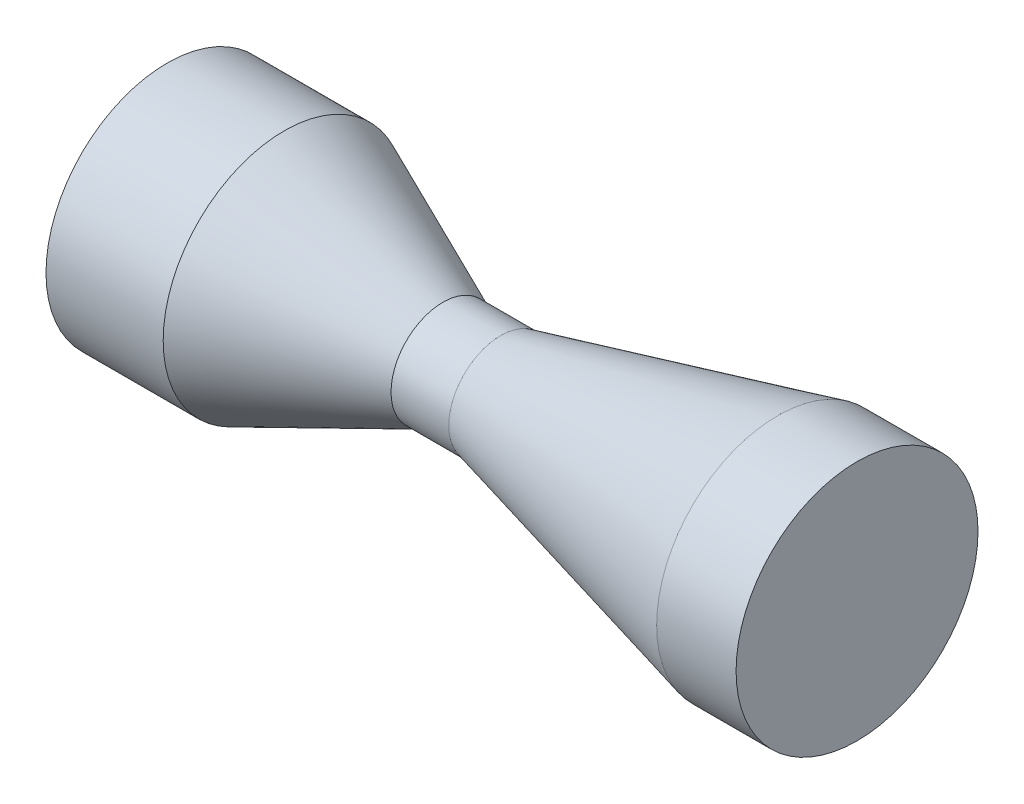
ISO-10303-21;
HEADER;
FILE_DESCRIPTION(('STEP AP214'),'2;1');
FILE_NAME('part.step','',(''),(''),'','','');
FILE_SCHEMA(('AUTOMOTIVE_DESIGN { 1 0 10303 214 1 1 1 1 }'));
ENDSEC;
DATA;
#1=APPLICATION_CONTEXT('core data for automotive mechanical design processes');
#2=APPLICATION_PROTOCOL_DEFINITION('international standard','automotive_design',2000,#1);
#3=PRODUCT_CONTEXT('',#1,'mechanical');
#4=PRODUCT('Part','Part','',(#3));
#5=PRODUCT_RELATED_PRODUCT_CATEGORY('part','',(#4));
#6=PRODUCT_DEFINITION_FORMATION('','',#4);
#7=PRODUCT_DEFINITION_CONTEXT('part definition',#1,'design');
#8=PRODUCT_DEFINITION('design','',#6,#7);
#9=PRODUCT_DEFINITION_SHAPE('','',#8);
#10=(LENGTH_UNIT() NAMED_UNIT(*) SI_UNIT(.MILLI.,.METRE.));
#11=(NAMED_UNIT(*) PLANE_ANGLE_UNIT() SI_UNIT($,.RADIAN.));
#12=(NAMED_UNIT(*) SI_UNIT($,.STERADIAN.) SOLID_ANGLE_UNIT());
#13=UNCERTAINTY_MEASURE_WITH_UNIT(LENGTH_MEASURE(1.E-05),#10,'distance_accuracy_value','');
#14=(GEOMETRIC_REPRESENTATION_CONTEXT(3) GLOBAL_UNCERTAINTY_ASSIGNED_CONTEXT((#13)) GLOBAL_UNIT_ASSIGNED_CONTEXT((#10,
#11,#12)) REPRESENTATION_CONTEXT('',''));
#15=CARTESIAN_POINT('',(0.,0.,0.));
#16=DIRECTION('',(0.,0.,1.));
#17=DIRECTION('',(1.,0.,0.));
#18=AXIS2_PLACEMENT_3D('',#15,#16,#17);
#19=CARTESIAN_POINT('',(140.821370464621,0.,0.));
#20=DIRECTION('',(1.,0.,0.));
#21=DIRECTION('',(0.,0.,-1.));
#22=AXIS2_PLACEMENT_3D('',#19,#20,#21);
#23=PLANE('',#22);
#24=CARTESIAN_POINT('',(140.821370464621,0.,0.));
#25=DIRECTION('',(1.,0.,0.));
#26=DIRECTION('',(0.,0.,-1.));
#27=AXIS2_PLACEMENT_3D('',#24,#25,#26);
#28=CIRCLE('',#27,34.9462402274546);
#29=CARTESIAN_POINT('',(140.821370464621,0.,-34.9462402274546));
#30=VERTEX_POINT('',#29);
#31=EDGE_CURVE('E119',#30,#30,#28,.T.);
#32=ORIENTED_EDGE('',*,*,#31,.T.);
#33=EDGE_LOOP('',(#32));
#34=FACE_BOUND('',#33,.T.);
#35=ADVANCED_FACE('F45',(#34),#23,.T.);
#36=CARTESIAN_POINT('',(-58.4948832055554,0.,0.));
#37=DIRECTION('',(-1.,0.,0.));
#38=DIRECTION('',(0.,0.,1.));
#39=AXIS2_PLACEMENT_3D('',#36,#37,#38);
#40=PLANE('',#39);
#41=CARTESIAN_POINT('',(-58.4948832055554,0.,0.));
#42=DIRECTION('',(-1.,0.,0.));
#43=DIRECTION('',(0.,0.,1.));
#44=AXIS2_PLACEMENT_3D('',#41,#42,#43);
#45=CIRCLE('',#44,35.);
#46=CARTESIAN_POINT('',(-58.4948832055554,0.,35.));
#47=VERTEX_POINT('',#46);
#48=EDGE_CURVE('E84',#47,#47,#45,.T.);
#49=ORIENTED_EDGE('',*,*,#48,.T.);
#50=EDGE_LOOP('',(#49));
#51=FACE_BOUND('',#50,.T.);
#52=ADVANCED_FACE('F140',(#51),#40,.T.);
#53=CARTESIAN_POINT('',(-43.0231598746545,0.,0.));
#54=DIRECTION('',(-1.,0.,0.));
#55=DIRECTION('',(0.,0.,1.));
#56=AXIS2_PLACEMENT_3D('',#53,#54,#55);
#57=CYLINDRICAL_SURFACE('',#56,35.);
#58=CARTESIAN_POINT('',(-24.6381928369166,0.,0.));
#59=DIRECTION('',(-1.,0.,0.));
#60=DIRECTION('',(0.,0.,1.));
#61=AXIS2_PLACEMENT_3D('',#58,#59,#60);
#62=CIRCLE('',#61,35.);
#63=CARTESIAN_POINT('',(-24.6381928369166,0.,35.));
#64=VERTEX_POINT('',#63);
#65=EDGE_CURVE('E85',#64,#64,#62,.T.);
#66=ORIENTED_EDGE('',*,*,#65,.T.);
#67=EDGE_LOOP('',(#66));
#68=FACE_BOUND('',#67,.T.);
#69=ORIENTED_EDGE('',*,*,#48,.F.);
#70=EDGE_LOOP('',(#69));
#71=FACE_BOUND('',#70,.T.);
#72=ADVANCED_FACE('F145',(#68,#71),#57,.T.);
#73=CARTESIAN_POINT('',(-24.6381928369166,0.,0.));
#74=DIRECTION('',(-1.,0.,0.));
#75=DIRECTION('',(0.,0.,1.));
#76=AXIS2_PLACEMENT_3D('',#73,#74,#75);
#77=CONICAL_SURFACE('',#76,35.,0.411516846067488);
#78=CARTESIAN_POINT('',(21.1875641126418,0.,0.));
#79=DIRECTION('',(-1.,0.,0.));
#80=DIRECTION('',(0.,0.,1.));
#81=AXIS2_PLACEMENT_3D('',#78,#79,#80);
#82=CIRCLE('',#81,15.);
#83=CARTESIAN_POINT('',(21.1875641126418,0.,15.));
#84=VERTEX_POINT('',#83);
#85=EDGE_CURVE('E97',#84,#84,#82,.T.);
#86=ORIENTED_EDGE('',*,*,#85,.T.);
#87=EDGE_LOOP('',(#86));
#88=FACE_BOUND('',#87,.T.);
#89=ORIENTED_EDGE('',*,*,#65,.F.);
#90=EDGE_LOOP('',(#89));
#91=FACE_BOUND('',#90,.T.);
#92=ADVANCED_FACE('F197',(#88,#91),#77,.T.);
#93=CARTESIAN_POINT('',(-43.0231598746545,0.,0.));
#94=DIRECTION('',(-1.,0.,0.));
#95=DIRECTION('',(0.,0.,1.));
#96=AXIS2_PLACEMENT_3D('',#93,#94,#95);
#97=CYLINDRICAL_SURFACE('',#96,15.);
#98=CARTESIAN_POINT('',(37.8725969783919,0.,0.));
#99=DIRECTION('',(-1.,0.,0.));
#100=DIRECTION('',(0.,0.,1.));
#101=AXIS2_PLACEMENT_3D('',#98,#99,#100);
#102=CIRCLE('',#101,15.);
#103=CARTESIAN_POINT('',(37.8725969783919,0.,15.));
#104=VERTEX_POINT('',#103);
#105=EDGE_CURVE('E102',#104,#104,#102,.T.);
#106=ORIENTED_EDGE('',*,*,#105,.T.);
#107=EDGE_LOOP('',(#106));
#108=FACE_BOUND('',#107,.T.);
#109=ORIENTED_EDGE('',*,*,#85,.F.);
#110=EDGE_LOOP('',(#109));
#111=FACE_BOUND('',#110,.T.);
#112=ADVANCED_FACE('F134',(#108,#111),#97,.T.);
#113=CARTESIAN_POINT('',(37.8725969783919,0.,0.));
#114=DIRECTION('',(1.,0.,0.));
#115=DIRECTION('',(0.,0.,-1.));
#116=AXIS2_PLACEMENT_3D('',#113,#114,#115);
#117=CONICAL_SURFACE('',#116,15.,0.244346095279207);
#118=CARTESIAN_POINT('',(117.872596978392,0.,0.));
#119=DIRECTION('',(-1.,0.,0.));
#120=DIRECTION('',(0.,0.,1.));
#121=AXIS2_PLACEMENT_3D('',#118,#119,#120);
#122=CIRCLE('',#121,34.9462402274545);
#123=CARTESIAN_POINT('',(117.872596978392,0.,34.9462402274545));
#124=VERTEX_POINT('',#123);
#125=EDGE_CURVE('E107',#124,#124,#122,.T.);
#126=ORIENTED_EDGE('',*,*,#125,.T.);
#127=EDGE_LOOP('',(#126));
#128=FACE_BOUND('',#127,.T.);
#129=ORIENTED_EDGE('',*,*,#105,.F.);
#130=EDGE_LOOP('',(#129));
#131=FACE_BOUND('',#130,.T.);
#132=ADVANCED_FACE('F127',(#128,#131),#117,.T.);
#133=CARTESIAN_POINT('',(-43.0231598746545,0.,0.));
#134=DIRECTION('',(-1.,0.,0.));
#135=DIRECTION('',(0.,0.,1.));
#136=AXIS2_PLACEMENT_3D('',#133,#134,#135);
#137=CYLINDRICAL_SURFACE('',#136,34.9462402274545);
#138=ORIENTED_EDGE('',*,*,#125,.F.);
#139=EDGE_LOOP('',(#138));
#140=FACE_BOUND('',#139,.T.);
#141=ORIENTED_EDGE('',*,*,#31,.F.);
#142=EDGE_LOOP('',(#141));
#143=FACE_BOUND('',#142,.T.);
#144=ADVANCED_FACE('F125',(#140,#143),#137,.T.);
#145=CLOSED_SHELL('',(#35,#52,#72,#92,#112,#132,#144));
#146=CARTESIAN_POINT('',(-43.0231598746545,0.,0.));
#147=DIRECTION('',(-1.,0.,0.));
#148=DIRECTION('',(0.,0.,1.));
#149=AXIS2_PLACEMENT_3D('',#146,#147,#148);
#150=CYLINDRICAL_SURFACE('',#149,24.9462402274545);
#151=CARTESIAN_POINT('',(138.821370464621,0.,0.));
#152=DIRECTION('',(-1.,0.,0.));
#153=DIRECTION('',(0.,0.,1.));
#154=AXIS2_PLACEMENT_3D('',#151,#152,#153);
#155=CIRCLE('',#154,24.9462402274545);
#156=CARTESIAN_POINT('',(138.821370464621,0.,24.9462402274545));
#157=VERTEX_POINT('',#156);
#158=EDGE_CURVE('E83',#157,#157,#155,.T.);
#159=ORIENTED_EDGE('',*,*,#158,.F.);
#160=EDGE_LOOP('',(#159));
#161=FACE_BOUND('',#160,.T.);
#162=CARTESIAN_POINT('',(119.100442587421,0.,0.));
#163=DIRECTION('',(-1.,0.,0.));
#164=DIRECTION('',(0.,0.,1.));
#165=AXIS2_PLACEMENT_3D('',#162,#163,#164);
#166=CIRCLE('',#165,24.9462402274545);
#167=CARTESIAN_POINT('',(119.100442587421,0.,24.9462402274545));
#168=VERTEX_POINT('',#167);
#169=EDGE_CURVE('E71',#168,#168,#166,.T.);
#170=ORIENTED_EDGE('',*,*,#169,.T.);
#171=EDGE_LOOP('',(#170));
#172=FACE_BOUND('',#171,.T.);
#173=ADVANCED_FACE('F162',(#161,#172),#150,.F.);
#174=CARTESIAN_POINT('',(39.100442587421,0.,0.));
#175=DIRECTION('',(1.,0.,0.));
#176=DIRECTION('',(0.,0.,-1.));
#177=AXIS2_PLACEMENT_3D('',#174,#175,#176);
#178=CONICAL_SURFACE('',#177,5.,0.244346095279207);
#179=CARTESIAN_POINT('',(40.2918159343886,0.,0.));
#180=DIRECTION('',(-1.,0.,0.));
#181=DIRECTION('',(0.,0.,1.));
#182=AXIS2_PLACEMENT_3D('',#179,#180,#181);
#183=CIRCLE('',#182,5.29704273724004);
#184=CARTESIAN_POINT('',(40.2918159343886,0.,5.29704273724004));
#185=VERTEX_POINT('',#184);
#186=EDGE_CURVE('E11',#185,#185,#183,.T.);
#187=ORIENTED_EDGE('',*,*,#186,.T.);
#188=EDGE_LOOP('',(#187));
#189=FACE_BOUND('',#188,.T.);
#190=ORIENTED_EDGE('',*,*,#169,.F.);
#191=EDGE_LOOP('',(#190));
#192=FACE_BOUND('',#191,.T.);
#193=ADVANCED_FACE('F163',(#189,#192),#178,.F.);
#194=CARTESIAN_POINT('',(-43.0231598746545,0.,0.));
#195=DIRECTION('',(-1.,0.,0.));
#196=DIRECTION('',(0.,0.,1.));
#197=AXIS2_PLACEMENT_3D('',#194,#195,#196);
#198=CYLINDRICAL_SURFACE('',#197,5.);
#199=CARTESIAN_POINT('',(21.1875641126418,0.,0.));
#200=DIRECTION('',(1.,0.,0.));
#201=DIRECTION('',(0.,0.,-1.));
#202=AXIS2_PLACEMENT_3D('',#199,#200,#201);
#203=CIRCLE('',#202,5.);
#204=CARTESIAN_POINT('',(21.1875641126418,0.,-5.));
#205=VERTEX_POINT('',#204);
#206=EDGE_CURVE('E60',#205,#205,#203,.F.);
#207=ORIENTED_EDGE('',*,*,#206,.T.);
#208=EDGE_LOOP('',(#207));
#209=FACE_BOUND('',#208,.T.);
#210=CARTESIAN_POINT('',(37.8725969783919,0.,0.));
#211=DIRECTION('',(1.,0.,0.));
#212=DIRECTION('',(0.,0.,-1.));
#213=AXIS2_PLACEMENT_3D('',#210,#211,#212);
#214=CIRCLE('',#213,5.);
#215=CARTESIAN_POINT('',(37.8725969783919,0.,-5.));
#216=VERTEX_POINT('',#215);
#217=EDGE_CURVE('E65',#216,#216,#214,.T.);
#218=ORIENTED_EDGE('',*,*,#217,.T.);
#219=EDGE_LOOP('',(#218));
#220=FACE_BOUND('',#219,.T.);
#221=ADVANCED_FACE('F169',(#209,#220),#198,.F.);
#222=CARTESIAN_POINT('',(-26.7253143621374,0.,0.));
#223=DIRECTION('',(-1.,0.,0.));
#224=DIRECTION('',(0.,0.,1.));
#225=AXIS2_PLACEMENT_3D('',#222,#223,#224);
#226=CONICAL_SURFACE('',#225,25.,0.411516846067488);
#227=CARTESIAN_POINT('',(17.1875641126418,0.,0.));
#228=DIRECTION('',(1.,0.,0.));
#229=DIRECTION('',(0.,0.,-1.));
#230=AXIS2_PLACEMENT_3D('',#227,#228,#229);
#231=CIRCLE('',#230,5.83484861008832);
#232=CARTESIAN_POINT('',(17.1875641126418,0.,-5.83484861008832));
#233=VERTEX_POINT('',#232);
#234=EDGE_CURVE('E55',#233,#233,#231,.T.);
#235=ORIENTED_EDGE('',*,*,#234,.T.);
#236=EDGE_LOOP('',(#235));
#237=FACE_BOUND('',#236,.T.);
#238=CARTESIAN_POINT('',(-26.7253143621374,0.,0.));
#239=DIRECTION('',(-1.,0.,0.));
#240=DIRECTION('',(0.,0.,1.));
#241=AXIS2_PLACEMENT_3D('',#238,#239,#240);
#242=CIRCLE('',#241,25.);
#243=CARTESIAN_POINT('',(-26.7253143621374,0.,25.));
#244=VERTEX_POINT('',#243);
#245=EDGE_CURVE('E87',#244,#244,#242,.T.);
#246=ORIENTED_EDGE('',*,*,#245,.T.);
#247=EDGE_LOOP('',(#246));
#248=FACE_BOUND('',#247,.T.);
#249=ADVANCED_FACE('F180',(#237,#248),#226,.F.);
#250=CARTESIAN_POINT('',(-43.0231598746545,0.,0.));
#251=DIRECTION('',(-1.,0.,0.));
#252=DIRECTION('',(0.,0.,1.));
#253=AXIS2_PLACEMENT_3D('',#250,#251,#252);
#254=CYLINDRICAL_SURFACE('',#253,25.);
#255=ORIENTED_EDGE('',*,*,#245,.F.);
#256=EDGE_LOOP('',(#255));
#257=FACE_BOUND('',#256,.T.);
#258=CARTESIAN_POINT('',(-56.4948832055554,0.,0.));
#259=DIRECTION('',(-1.,0.,0.));
#260=DIRECTION('',(0.,0.,1.));
#261=AXIS2_PLACEMENT_3D('',#258,#259,#260);
#262=CIRCLE('',#261,25.);
#263=CARTESIAN_POINT('',(-56.4948832055554,0.,25.));
#264=VERTEX_POINT('',#263);
#265=EDGE_CURVE('E78',#264,#264,#262,.T.);
#266=ORIENTED_EDGE('',*,*,#265,.T.);
#267=EDGE_LOOP('',(#266));
#268=FACE_BOUND('',#267,.T.);
#269=ADVANCED_FACE('F175',(#257,#268),#254,.F.);
#270=CARTESIAN_POINT('',(21.1875641126418,0.,0.));
#271=DIRECTION('',(1.,0.,0.));
#272=DIRECTION('',(0.,0.,-1.));
#273=AXIS2_PLACEMENT_3D('',#270,#271,#272);
#274=TOROIDAL_SURFACE('',#273,15.,10.);
#275=ORIENTED_EDGE('',*,*,#234,.F.);
#276=EDGE_LOOP('',(#275));
#277=FACE_BOUND('',#276,.T.);
#278=ORIENTED_EDGE('',*,*,#206,.F.);
#279=EDGE_LOOP('',(#278));
#280=FACE_BOUND('',#279,.T.);
#281=ADVANCED_FACE('F159',(#277,#280),#274,.T.);
#282=CARTESIAN_POINT('',(37.8725969783919,0.,0.));
#283=DIRECTION('',(1.,0.,0.));
#284=DIRECTION('',(0.,0.,-1.));
#285=AXIS2_PLACEMENT_3D('',#282,#283,#284);
#286=TOROIDAL_SURFACE('',#285,15.,10.);
#287=ORIENTED_EDGE('',*,*,#217,.F.);
#288=EDGE_LOOP('',(#287));
#289=FACE_BOUND('',#288,.T.);
#290=ORIENTED_EDGE('',*,*,#186,.F.);
#291=EDGE_LOOP('',(#290));
#292=FACE_BOUND('',#291,.T.);
#293=ADVANCED_FACE('F47',(#289,#292),#286,.T.);
#294=CARTESIAN_POINT('',(-56.4948832055554,0.,0.));
#295=DIRECTION('',(-1.,0.,0.));
#296=DIRECTION('',(0.,0.,1.));
#297=AXIS2_PLACEMENT_3D('',#294,#295,#296);
#298=PLANE('',#297);
#299=ORIENTED_EDGE('',*,*,#265,.F.);
#300=EDGE_LOOP('',(#299));
#301=FACE_BOUND('',#300,.T.);
#302=ADVANCED_FACE('F151',(#301),#298,.F.);
#303=CARTESIAN_POINT('',(138.821370464621,0.,0.));
#304=DIRECTION('',(1.,0.,0.));
#305=DIRECTION('',(0.,0.,-1.));
#306=AXIS2_PLACEMENT_3D('',#303,#304,#305);
#307=PLANE('',#306);
#308=ORIENTED_EDGE('',*,*,#158,.T.);
#309=EDGE_LOOP('',(#308));
#310=FACE_BOUND('',#309,.T.);
#311=ADVANCED_FACE('F149',(#310),#307,.F.);
#312=CLOSED_SHELL('',(#173,#193,#221,#249,#269,#281,#293,#302,#311));
#313=ORIENTED_CLOSED_SHELL('',*,#312,.T.);
#314=BREP_WITH_VOIDS('B2',#145,(#313));
#315=ADVANCED_BREP_SHAPE_REPRESENTATION('',(#18,#314),#14);
#316=SHAPE_DEFINITION_REPRESENTATION(#9,#315);
ENDSEC;
END-ISO-10303-21;
